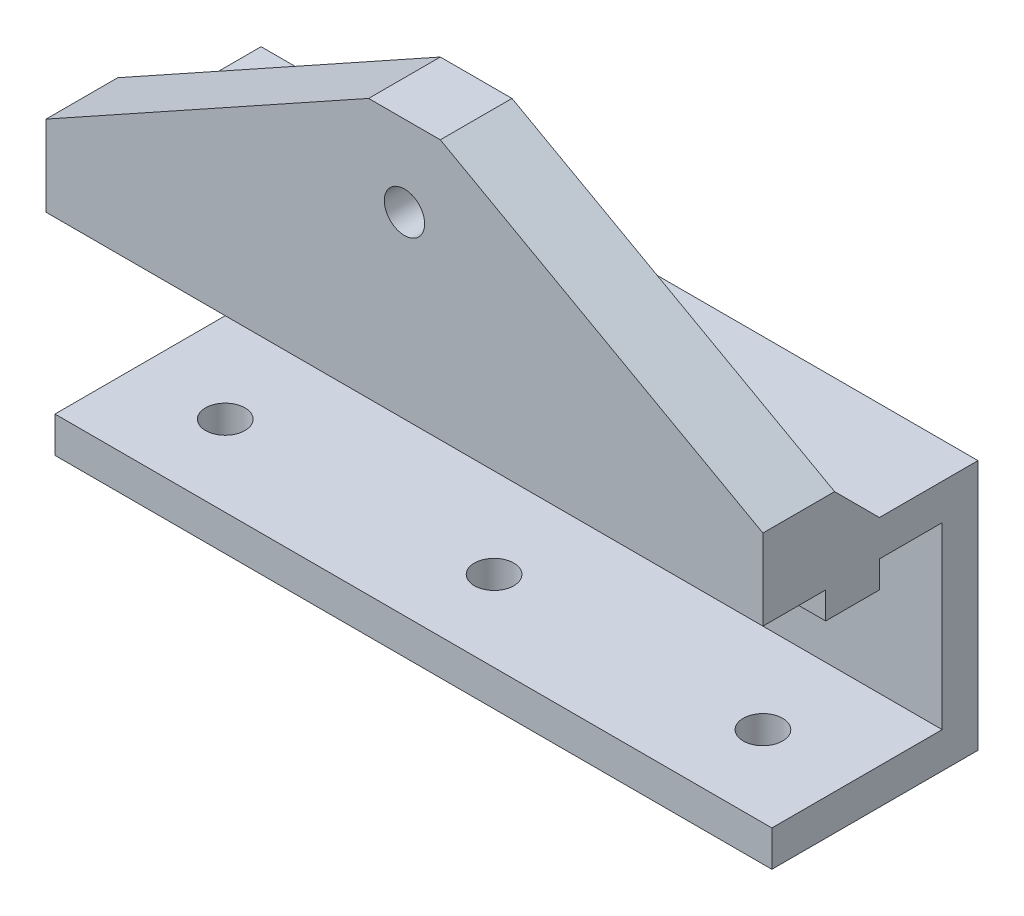
ISO-10303-21;
HEADER;
FILE_DESCRIPTION(('STEP AP214'),'2;1');
FILE_NAME('part.step','',(''),(''),'','','');
FILE_SCHEMA(('AUTOMOTIVE_DESIGN { 1 0 10303 214 1 1 1 1 }'));
ENDSEC;
DATA;
#1=APPLICATION_CONTEXT('core data for automotive mechanical design processes');
#2=APPLICATION_PROTOCOL_DEFINITION('international standard','automotive_design',2000,#1);
#3=PRODUCT_CONTEXT('',#1,'mechanical');
#4=PRODUCT('Part','Part','',(#3));
#5=PRODUCT_RELATED_PRODUCT_CATEGORY('part','',(#4));
#6=PRODUCT_DEFINITION_FORMATION('','',#4);
#7=PRODUCT_DEFINITION_CONTEXT('part definition',#1,'design');
#8=PRODUCT_DEFINITION('design','',#6,#7);
#9=PRODUCT_DEFINITION_SHAPE('','',#8);
#10=(LENGTH_UNIT() NAMED_UNIT(*) SI_UNIT(.MILLI.,.METRE.));
#11=(NAMED_UNIT(*) PLANE_ANGLE_UNIT() SI_UNIT($,.RADIAN.));
#12=(NAMED_UNIT(*) SI_UNIT($,.STERADIAN.) SOLID_ANGLE_UNIT());
#13=UNCERTAINTY_MEASURE_WITH_UNIT(LENGTH_MEASURE(1.E-05),#10,'distance_accuracy_value','');
#14=(GEOMETRIC_REPRESENTATION_CONTEXT(3) GLOBAL_UNCERTAINTY_ASSIGNED_CONTEXT((#13)) GLOBAL_UNIT_ASSIGNED_CONTEXT((#10,
#11,#12)) REPRESENTATION_CONTEXT('',''));
#15=CARTESIAN_POINT('',(0.,0.,0.));
#16=DIRECTION('',(0.,0.,1.));
#17=DIRECTION('',(1.,0.,0.));
#18=AXIS2_PLACEMENT_3D('',#15,#16,#17);
#19=CARTESIAN_POINT('',(40.,2.73442776024904,26.8389938788187));
#20=DIRECTION('',(0.,0.,-1.));
#21=DIRECTION('',(0.,1.,0.));
#22=AXIS2_PLACEMENT_3D('',#19,#20,#21);
#23=CYLINDRICAL_SURFACE('',#22,2.25);
#24=CARTESIAN_POINT('',(40.,2.73442776024905,34.8389938788187));
#25=DIRECTION('',(0.,0.,-1.));
#26=DIRECTION('',(0.,1.,0.));
#27=AXIS2_PLACEMENT_3D('',#24,#25,#26);
#28=CIRCLE('',#27,2.25);
#29=CARTESIAN_POINT('',(40.,4.98442776024905,34.8389938788187));
#30=VERTEX_POINT('',#29);
#31=EDGE_CURVE('E278',#30,#30,#28,.T.);
#32=ORIENTED_EDGE('',*,*,#31,.F.);
#33=EDGE_LOOP('',(#32));
#34=FACE_BOUND('',#33,.T.);
#35=CARTESIAN_POINT('',(40.,2.73442776024905,30.8389938788187));
#36=DIRECTION('',(0.,0.,-1.));
#37=DIRECTION('',(-1.,0.,0.));
#38=AXIS2_PLACEMENT_3D('',#35,#36,#37);
#39=CIRCLE('',#38,2.25);
#40=CARTESIAN_POINT('',(37.75,2.73442776024905,30.8389938788187));
#41=VERTEX_POINT('',#40);
#42=EDGE_CURVE('E42',#41,#41,#39,.F.);
#43=ORIENTED_EDGE('',*,*,#42,.F.);
#44=EDGE_LOOP('',(#43));
#45=FACE_BOUND('',#44,.T.);
#46=ADVANCED_FACE('F38',(#34,#45),#23,.F.);
#47=CARTESIAN_POINT('',(80.,-41.265572239751,33.8389938788187));
#48=DIRECTION('',(0.,0.,-1.));
#49=DIRECTION('',(-1.,0.,0.));
#50=AXIS2_PLACEMENT_3D('',#47,#48,#49);
#51=PLANE('',#50);
#52=DIRECTION('',(0.,-1.,0.));
#53=VECTOR('',#52,1.);
#54=CARTESIAN_POINT('',(0.,-41.265572239751,33.8389938788187));
#55=LINE('',#54,#53);
#56=CARTESIAN_POINT('',(0.,-37.265572239751,33.8389938788187));
#57=VERTEX_POINT('',#56);
#58=CARTESIAN_POINT('',(0.,-41.265572239751,33.8389938788187));
#59=VERTEX_POINT('',#58);
#60=EDGE_CURVE('E297',#57,#59,#55,.T.);
#61=ORIENTED_EDGE('',*,*,#60,.T.);
#62=DIRECTION('',(-1.,0.,0.));
#63=VECTOR('',#62,1.);
#64=CARTESIAN_POINT('',(80.,-41.265572239751,33.8389938788187));
#65=LINE('',#64,#63);
#66=CARTESIAN_POINT('',(80.,-41.265572239751,33.8389938788187));
#67=VERTEX_POINT('',#66);
#68=EDGE_CURVE('E11',#67,#59,#65,.T.);
#69=ORIENTED_EDGE('',*,*,#68,.F.);
#70=DIRECTION('',(0.,-1.,0.));
#71=VECTOR('',#70,1.);
#72=CARTESIAN_POINT('',(80.,-41.265572239751,33.8389938788187));
#73=LINE('',#72,#71);
#74=CARTESIAN_POINT('',(80.,-37.265572239751,33.8389938788187));
#75=VERTEX_POINT('',#74);
#76=EDGE_CURVE('E306',#75,#67,#73,.T.);
#77=ORIENTED_EDGE('',*,*,#76,.F.);
#78=DIRECTION('',(-1.,0.,0.));
#79=VECTOR('',#78,1.);
#80=CARTESIAN_POINT('',(80.,-37.265572239751,33.8389938788187));
#81=LINE('',#80,#79);
#82=EDGE_CURVE('E346',#75,#57,#81,.T.);
#83=ORIENTED_EDGE('',*,*,#82,.T.);
#84=EDGE_LOOP('',(#61,#69,#77,#83));
#85=FACE_BOUND('',#84,.T.);
#86=ADVANCED_FACE('F40',(#85),#51,.F.);
#87=CARTESIAN_POINT('',(80.,-41.265572239751,10.8389938788187));
#88=DIRECTION('',(0.,1.,0.));
#89=DIRECTION('',(0.,0.,1.));
#90=AXIS2_PLACEMENT_3D('',#87,#88,#89);
#91=PLANE('',#90);
#92=CARTESIAN_POINT('',(10.,-41.265572239751,24.8389938788187));
#93=DIRECTION('',(0.,-1.,0.));
#94=DIRECTION('',(0.,0.,-1.));
#95=AXIS2_PLACEMENT_3D('',#92,#93,#94);
#96=CIRCLE('',#95,2.2);
#97=CARTESIAN_POINT('',(10.,-41.265572239751,22.6389938788187));
#98=VERTEX_POINT('',#97);
#99=EDGE_CURVE('E556',#98,#98,#96,.T.);
#100=ORIENTED_EDGE('',*,*,#99,.F.);
#101=EDGE_LOOP('',(#100));
#102=FACE_BOUND('',#101,.T.);
#103=CARTESIAN_POINT('',(40.,-41.265572239751,24.8389938788187));
#104=DIRECTION('',(0.,-1.,0.));
#105=DIRECTION('',(0.,0.,-1.));
#106=AXIS2_PLACEMENT_3D('',#103,#104,#105);
#107=CIRCLE('',#106,2.2);
#108=CARTESIAN_POINT('',(40.,-41.265572239751,22.6389938788187));
#109=VERTEX_POINT('',#108);
#110=EDGE_CURVE('E562',#109,#109,#107,.T.);
#111=ORIENTED_EDGE('',*,*,#110,.F.);
#112=EDGE_LOOP('',(#111));
#113=FACE_BOUND('',#112,.T.);
#114=CARTESIAN_POINT('',(70.,-41.265572239751,24.8389938788187));
#115=DIRECTION('',(0.,-1.,0.));
#116=DIRECTION('',(0.,0.,-1.));
#117=AXIS2_PLACEMENT_3D('',#114,#115,#116);
#118=CIRCLE('',#117,2.19999999999999);
#119=CARTESIAN_POINT('',(70.,-41.265572239751,22.6389938788187));
#120=VERTEX_POINT('',#119);
#121=EDGE_CURVE('E573',#120,#120,#118,.T.);
#122=ORIENTED_EDGE('',*,*,#121,.F.);
#123=EDGE_LOOP('',(#122));
#124=FACE_BOUND('',#123,.T.);
#125=DIRECTION('',(0.,0.,-1.));
#126=VECTOR('',#125,1.);
#127=CARTESIAN_POINT('',(0.,-41.265572239751,10.8389938788187));
#128=LINE('',#127,#126);
#129=CARTESIAN_POINT('',(0.,-41.265572239751,10.8389938788187));
#130=VERTEX_POINT('',#129);
#131=EDGE_CURVE('E349',#59,#130,#128,.T.);
#132=ORIENTED_EDGE('',*,*,#131,.T.);
#133=DIRECTION('',(-1.,0.,0.));
#134=VECTOR('',#133,1.);
#135=CARTESIAN_POINT('',(80.,-41.265572239751,10.8389938788187));
#136=LINE('',#135,#134);
#137=CARTESIAN_POINT('',(80.,-41.265572239751,10.8389938788187));
#138=VERTEX_POINT('',#137);
#139=EDGE_CURVE('E48',#138,#130,#136,.T.);
#140=ORIENTED_EDGE('',*,*,#139,.F.);
#141=DIRECTION('',(0.,0.,-1.));
#142=VECTOR('',#141,1.);
#143=CARTESIAN_POINT('',(80.,-41.265572239751,10.8389938788187));
#144=LINE('',#143,#142);
#145=EDGE_CURVE('E310',#67,#138,#144,.T.);
#146=ORIENTED_EDGE('',*,*,#145,.F.);
#147=ORIENTED_EDGE('',*,*,#68,.T.);
#148=EDGE_LOOP('',(#132,#140,#146,#147));
#149=FACE_BOUND('',#148,.T.);
#150=ADVANCED_FACE('F449',(#102,#113,#124,#149),#91,.F.);
#151=CARTESIAN_POINT('',(80.,-13.265572239751,10.8389938788187));
#152=DIRECTION('',(0.,0.,1.));
#153=DIRECTION('',(0.,-1.,0.));
#154=AXIS2_PLACEMENT_3D('',#151,#152,#153);
#155=PLANE('',#154);
#156=DIRECTION('',(0.,1.,0.));
#157=VECTOR('',#156,1.);
#158=CARTESIAN_POINT('',(0.,-13.265572239751,10.8389938788187));
#159=LINE('',#158,#157);
#160=CARTESIAN_POINT('',(0.,-13.265572239751,10.8389938788187));
#161=VERTEX_POINT('',#160);
#162=EDGE_CURVE('E351',#130,#161,#159,.T.);
#163=ORIENTED_EDGE('',*,*,#162,.T.);
#164=DIRECTION('',(-1.,0.,0.));
#165=VECTOR('',#164,1.);
#166=CARTESIAN_POINT('',(80.,-13.265572239751,10.8389938788187));
#167=LINE('',#166,#165);
#168=CARTESIAN_POINT('',(80.,-13.265572239751,10.8389938788187));
#169=VERTEX_POINT('',#168);
#170=EDGE_CURVE('E419',#169,#161,#167,.T.);
#171=ORIENTED_EDGE('',*,*,#170,.F.);
#172=DIRECTION('',(0.,1.,0.));
#173=VECTOR('',#172,1.);
#174=CARTESIAN_POINT('',(80.,-13.265572239751,10.8389938788187));
#175=LINE('',#174,#173);
#176=EDGE_CURVE('E314',#138,#169,#175,.T.);
#177=ORIENTED_EDGE('',*,*,#176,.F.);
#178=ORIENTED_EDGE('',*,*,#139,.T.);
#179=EDGE_LOOP('',(#163,#171,#177,#178));
#180=FACE_BOUND('',#179,.T.);
#181=ADVANCED_FACE('F428',(#180),#155,.F.);
#182=CARTESIAN_POINT('',(80.,-13.265572239751,21.8389938788187));
#183=DIRECTION('',(0.,-1.,0.));
#184=DIRECTION('',(0.,0.,-1.));
#185=AXIS2_PLACEMENT_3D('',#182,#183,#184);
#186=PLANE('',#185);
#187=DIRECTION('',(0.,0.,1.));
#188=VECTOR('',#187,1.);
#189=CARTESIAN_POINT('',(0.,-13.265572239751,21.8389938788187));
#190=LINE('',#189,#188);
#191=CARTESIAN_POINT('',(0.,-13.265572239751,21.8389938788187));
#192=VERTEX_POINT('',#191);
#193=EDGE_CURVE('E353',#161,#192,#190,.T.);
#194=ORIENTED_EDGE('',*,*,#193,.T.);
#195=DIRECTION('',(-1.,0.,0.));
#196=VECTOR('',#195,1.);
#197=CARTESIAN_POINT('',(80.,-13.265572239751,21.8389938788187));
#198=LINE('',#197,#196);
#199=CARTESIAN_POINT('',(80.,-13.265572239751,21.8389938788187));
#200=VERTEX_POINT('',#199);
#201=EDGE_CURVE('E415',#200,#192,#198,.T.);
#202=ORIENTED_EDGE('',*,*,#201,.F.);
#203=DIRECTION('',(0.,0.,1.));
#204=VECTOR('',#203,1.);
#205=CARTESIAN_POINT('',(80.,-13.265572239751,21.8389938788187));
#206=LINE('',#205,#204);
#207=EDGE_CURVE('E317',#169,#200,#206,.T.);
#208=ORIENTED_EDGE('',*,*,#207,.F.);
#209=ORIENTED_EDGE('',*,*,#170,.T.);
#210=EDGE_LOOP('',(#194,#202,#208,#209));
#211=FACE_BOUND('',#210,.T.);
#212=ADVANCED_FACE('F438',(#211),#186,.F.);
#213=CARTESIAN_POINT('',(80.,-8.26557223975096,26.8389938788187));
#214=DIRECTION('',(0.,-0.707106781186547,0.707106781186548));
#215=DIRECTION('',(0.,-0.707106781186548,-0.707106781186547));
#216=AXIS2_PLACEMENT_3D('',#213,#214,#215);
#217=PLANE('',#216);
#218=DIRECTION('',(0.,0.707106781186548,0.707106781186547));
#219=VECTOR('',#218,1.);
#220=CARTESIAN_POINT('',(0.,-8.26557223975096,26.8389938788187));
#221=LINE('',#220,#219);
#222=CARTESIAN_POINT('',(0.,-8.26557223975096,26.8389938788187));
#223=VERTEX_POINT('',#222);
#224=EDGE_CURVE('E355',#192,#223,#221,.T.);
#225=ORIENTED_EDGE('',*,*,#224,.T.);
#226=DIRECTION('',(-1.,0.,0.));
#227=VECTOR('',#226,1.);
#228=CARTESIAN_POINT('',(80.,-8.26557223975096,26.8389938788187));
#229=LINE('',#228,#227);
#230=CARTESIAN_POINT('',(80.,-8.26557223975096,26.8389938788187));
#231=VERTEX_POINT('',#230);
#232=EDGE_CURVE('E411',#231,#223,#229,.T.);
#233=ORIENTED_EDGE('',*,*,#232,.F.);
#234=DIRECTION('',(0.,0.707106781186548,0.707106781186547));
#235=VECTOR('',#234,1.);
#236=CARTESIAN_POINT('',(80.,-8.26557223975096,26.8389938788187));
#237=LINE('',#236,#235);
#238=EDGE_CURVE('E319',#200,#231,#237,.T.);
#239=ORIENTED_EDGE('',*,*,#238,.F.);
#240=ORIENTED_EDGE('',*,*,#201,.T.);
#241=EDGE_LOOP('',(#225,#233,#239,#240));
#242=FACE_BOUND('',#241,.T.);
#243=ADVANCED_FACE('F442',(#242),#217,.F.);
#244=CARTESIAN_POINT('',(80.,11.734427760249,26.8389938788187));
#245=DIRECTION('',(0.,0.,1.));
#246=DIRECTION('',(0.,-1.,0.));
#247=AXIS2_PLACEMENT_3D('',#244,#245,#246);
#248=PLANE('',#247);
#249=DIRECTION('',(0.866025403784439,-0.5,0.));
#250=VECTOR('',#249,1.);
#251=CARTESIAN_POINT('',(40.,6.73442776024905,26.8389938788187));
#252=LINE('',#251,#250);
#253=CARTESIAN_POINT('',(40.,6.73442776024905,26.8389938788187));
#254=VERTEX_POINT('',#253);
#255=CARTESIAN_POINT('',(43.4641016151378,4.73442776024905,26.8389938788187));
#256=VERTEX_POINT('',#255);
#257=EDGE_CURVE('E254',#254,#256,#252,.T.);
#258=ORIENTED_EDGE('',*,*,#257,.F.);
#259=DIRECTION('',(0.866025403784439,0.5,0.));
#260=VECTOR('',#259,1.);
#261=CARTESIAN_POINT('',(36.5358983848622,4.73442776024904,26.8389938788187));
#262=LINE('',#261,#260);
#263=CARTESIAN_POINT('',(36.5358983848622,4.73442776024904,26.8389938788187));
#264=VERTEX_POINT('',#263);
#265=EDGE_CURVE('E55',#264,#254,#262,.T.);
#266=ORIENTED_EDGE('',*,*,#265,.F.);
#267=DIRECTION('',(0.,1.,0.));
#268=VECTOR('',#267,1.);
#269=CARTESIAN_POINT('',(36.5358983848622,0.734427760249041,26.8389938788187));
#270=LINE('',#269,#268);
#271=CARTESIAN_POINT('',(36.5358983848622,0.734427760249041,26.8389938788187));
#272=VERTEX_POINT('',#271);
#273=EDGE_CURVE('E232',#272,#264,#270,.T.);
#274=ORIENTED_EDGE('',*,*,#273,.F.);
#275=DIRECTION('',(-0.866025403784439,0.5,0.));
#276=VECTOR('',#275,1.);
#277=CARTESIAN_POINT('',(40.,-1.26557223975096,26.8389938788187));
#278=LINE('',#277,#276);
#279=CARTESIAN_POINT('',(40.,-1.26557223975096,26.8389938788187));
#280=VERTEX_POINT('',#279);
#281=EDGE_CURVE('E237',#280,#272,#278,.T.);
#282=ORIENTED_EDGE('',*,*,#281,.F.);
#283=DIRECTION('',(-0.866025403784439,-0.5,0.));
#284=VECTOR('',#283,1.);
#285=CARTESIAN_POINT('',(43.4641016151378,0.734427760249036,26.8389938788187));
#286=LINE('',#285,#284);
#287=CARTESIAN_POINT('',(43.4641016151378,0.734427760249036,26.8389938788187));
#288=VERTEX_POINT('',#287);
#289=EDGE_CURVE('E259',#288,#280,#286,.T.);
#290=ORIENTED_EDGE('',*,*,#289,.F.);
#291=DIRECTION('',(0.,-1.,0.));
#292=VECTOR('',#291,1.);
#293=CARTESIAN_POINT('',(43.4641016151378,4.73442776024905,26.8389938788187));
#294=LINE('',#293,#292);
#295=EDGE_CURVE('E256',#256,#288,#294,.T.);
#296=ORIENTED_EDGE('',*,*,#295,.F.);
#297=EDGE_LOOP('',(#258,#266,#274,#282,#290,#296));
#298=FACE_BOUND('',#297,.T.);
#299=ORIENTED_EDGE('',*,*,#232,.T.);
#300=DIRECTION('',(-0.874157276121538,-0.485642931178632,0.));
#301=VECTOR('',#300,1.);
#302=CARTESIAN_POINT('',(36.,11.734427760249,26.8389938788187));
#303=LINE('',#302,#301);
#304=CARTESIAN_POINT('',(36.,11.734427760249,26.8389938788187));
#305=VERTEX_POINT('',#304);
#306=EDGE_CURVE('E286',#305,#223,#303,.T.);
#307=ORIENTED_EDGE('',*,*,#306,.F.);
#308=DIRECTION('',(-1.,0.,0.));
#309=VECTOR('',#308,1.);
#310=CARTESIAN_POINT('',(80.,11.734427760249,26.8389938788187));
#311=LINE('',#310,#309);
#312=CARTESIAN_POINT('',(44.,11.734427760249,26.8389938788187));
#313=VERTEX_POINT('',#312);
#314=EDGE_CURVE('E408',#313,#305,#311,.T.);
#315=ORIENTED_EDGE('',*,*,#314,.F.);
#316=DIRECTION('',(-0.874157276121538,0.485642931178632,0.));
#317=VECTOR('',#316,1.);
#318=CARTESIAN_POINT('',(80.,-8.26557223975096,26.8389938788187));
#319=LINE('',#318,#317);
#320=EDGE_CURVE('E282',#231,#313,#319,.T.);
#321=ORIENTED_EDGE('',*,*,#320,.F.);
#322=EDGE_LOOP('',(#299,#307,#315,#321));
#323=FACE_BOUND('',#322,.T.);
#324=ADVANCED_FACE('F500',(#298,#323),#248,.F.);
#325=CARTESIAN_POINT('',(80.,11.734427760249,34.8389938788187));
#326=DIRECTION('',(0.,-1.,0.));
#327=DIRECTION('',(0.,0.,-1.));
#328=AXIS2_PLACEMENT_3D('',#325,#326,#327);
#329=PLANE('',#328);
#330=ORIENTED_EDGE('',*,*,#314,.T.);
#331=DIRECTION('',(0.,0.,-1.));
#332=VECTOR('',#331,1.);
#333=CARTESIAN_POINT('',(36.,11.734427760249,34.8389938788187));
#334=LINE('',#333,#332);
#335=CARTESIAN_POINT('',(36.,11.734427760249,34.8389938788187));
#336=VERTEX_POINT('',#335);
#337=EDGE_CURVE('E298',#336,#305,#334,.T.);
#338=ORIENTED_EDGE('',*,*,#337,.F.);
#339=DIRECTION('',(-1.,0.,0.));
#340=VECTOR('',#339,1.);
#341=CARTESIAN_POINT('',(80.,11.734427760249,34.8389938788187));
#342=LINE('',#341,#340);
#343=CARTESIAN_POINT('',(44.,11.734427760249,34.8389938788187));
#344=VERTEX_POINT('',#343);
#345=EDGE_CURVE('E404',#344,#336,#342,.T.);
#346=ORIENTED_EDGE('',*,*,#345,.F.);
#347=DIRECTION('',(0.,0.,-1.));
#348=VECTOR('',#347,1.);
#349=CARTESIAN_POINT('',(44.,11.734427760249,34.8389938788187));
#350=LINE('',#349,#348);
#351=EDGE_CURVE('E301',#344,#313,#350,.T.);
#352=ORIENTED_EDGE('',*,*,#351,.T.);
#353=EDGE_LOOP('',(#330,#338,#346,#352));
#354=FACE_BOUND('',#353,.T.);
#355=ADVANCED_FACE('F496',(#354),#329,.F.);
#356=CARTESIAN_POINT('',(80.,-17.265572239751,34.8389938788187));
#357=DIRECTION('',(0.,0.,-1.));
#358=DIRECTION('',(0.,1.,0.));
#359=AXIS2_PLACEMENT_3D('',#356,#357,#358);
#360=PLANE('',#359);
#361=ORIENTED_EDGE('',*,*,#31,.T.);
#362=EDGE_LOOP('',(#361));
#363=FACE_BOUND('',#362,.T.);
#364=ORIENTED_EDGE('',*,*,#345,.T.);
#365=DIRECTION('',(-0.874157276121538,-0.485642931178632,0.));
#366=VECTOR('',#365,1.);
#367=CARTESIAN_POINT('',(36.,11.734427760249,34.8389938788187));
#368=LINE('',#367,#366);
#369=CARTESIAN_POINT('',(0.,-8.26557223975095,34.8389938788187));
#370=VERTEX_POINT('',#369);
#371=EDGE_CURVE('E285',#336,#370,#368,.T.);
#372=ORIENTED_EDGE('',*,*,#371,.T.);
#373=DIRECTION('',(0.,-1.,0.));
#374=VECTOR('',#373,1.);
#375=CARTESIAN_POINT('',(0.,-17.265572239751,34.8389938788187));
#376=LINE('',#375,#374);
#377=CARTESIAN_POINT('',(0.,-17.265572239751,34.8389938788187));
#378=VERTEX_POINT('',#377);
#379=EDGE_CURVE('E358',#370,#378,#376,.T.);
#380=ORIENTED_EDGE('',*,*,#379,.T.);
#381=DIRECTION('',(-1.,0.,0.));
#382=VECTOR('',#381,1.);
#383=CARTESIAN_POINT('',(80.,-17.265572239751,34.8389938788187));
#384=LINE('',#383,#382);
#385=CARTESIAN_POINT('',(80.,-17.265572239751,34.8389938788187));
#386=VERTEX_POINT('',#385);
#387=EDGE_CURVE('E400',#386,#378,#384,.T.);
#388=ORIENTED_EDGE('',*,*,#387,.F.);
#389=DIRECTION('',(0.,-1.,0.));
#390=VECTOR('',#389,1.);
#391=CARTESIAN_POINT('',(80.,-17.265572239751,34.8389938788187));
#392=LINE('',#391,#390);
#393=CARTESIAN_POINT('',(80.,-8.26557223975096,34.8389938788187));
#394=VERTEX_POINT('',#393);
#395=EDGE_CURVE('E322',#394,#386,#392,.T.);
#396=ORIENTED_EDGE('',*,*,#395,.F.);
#397=DIRECTION('',(-0.874157276121538,0.485642931178632,0.));
#398=VECTOR('',#397,1.);
#399=CARTESIAN_POINT('',(80.,-8.26557223975095,34.8389938788187));
#400=LINE('',#399,#398);
#401=EDGE_CURVE('E66',#394,#344,#400,.T.);
#402=ORIENTED_EDGE('',*,*,#401,.T.);
#403=EDGE_LOOP('',(#364,#372,#380,#388,#396,#402));
#404=FACE_BOUND('',#403,.T.);
#405=ADVANCED_FACE('F489',(#363,#404),#360,.F.);
#406=CARTESIAN_POINT('',(80.,-17.265572239751,27.8389938788187));
#407=DIRECTION('',(0.,1.,0.));
#408=DIRECTION('',(0.,0.,1.));
#409=AXIS2_PLACEMENT_3D('',#406,#407,#408);
#410=PLANE('',#409);
#411=DIRECTION('',(0.,0.,-1.));
#412=VECTOR('',#411,1.);
#413=CARTESIAN_POINT('',(0.,-17.265572239751,27.8389938788187));
#414=LINE('',#413,#412);
#415=CARTESIAN_POINT('',(0.,-17.265572239751,27.8389938788187));
#416=VERTEX_POINT('',#415);
#417=EDGE_CURVE('E360',#378,#416,#414,.T.);
#418=ORIENTED_EDGE('',*,*,#417,.T.);
#419=DIRECTION('',(-1.,0.,0.));
#420=VECTOR('',#419,1.);
#421=CARTESIAN_POINT('',(80.,-17.265572239751,27.8389938788187));
#422=LINE('',#421,#420);
#423=CARTESIAN_POINT('',(80.,-17.265572239751,27.8389938788187));
#424=VERTEX_POINT('',#423);
#425=EDGE_CURVE('E396',#424,#416,#422,.T.);
#426=ORIENTED_EDGE('',*,*,#425,.F.);
#427=DIRECTION('',(0.,0.,-1.));
#428=VECTOR('',#427,1.);
#429=CARTESIAN_POINT('',(80.,-17.265572239751,27.8389938788187));
#430=LINE('',#429,#428);
#431=EDGE_CURVE('E325',#386,#424,#430,.T.);
#432=ORIENTED_EDGE('',*,*,#431,.F.);
#433=ORIENTED_EDGE('',*,*,#387,.T.);
#434=EDGE_LOOP('',(#418,#426,#432,#433));
#435=FACE_BOUND('',#434,.T.);
#436=ADVANCED_FACE('F485',(#435),#410,.F.);
#437=CARTESIAN_POINT('',(80.,-20.265572239751,27.8389938788187));
#438=DIRECTION('',(0.,0.,-1.));
#439=DIRECTION('',(-1.,0.,0.));
#440=AXIS2_PLACEMENT_3D('',#437,#438,#439);
#441=PLANE('',#440);
#442=DIRECTION('',(0.,-1.,0.));
#443=VECTOR('',#442,1.);
#444=CARTESIAN_POINT('',(0.,-20.265572239751,27.8389938788187));
#445=LINE('',#444,#443);
#446=CARTESIAN_POINT('',(0.,-20.265572239751,27.8389938788187));
#447=VERTEX_POINT('',#446);
#448=EDGE_CURVE('E362',#416,#447,#445,.T.);
#449=ORIENTED_EDGE('',*,*,#448,.T.);
#450=DIRECTION('',(-1.,0.,0.));
#451=VECTOR('',#450,1.);
#452=CARTESIAN_POINT('',(80.,-20.265572239751,27.8389938788187));
#453=LINE('',#452,#451);
#454=CARTESIAN_POINT('',(80.,-20.265572239751,27.8389938788187));
#455=VERTEX_POINT('',#454);
#456=EDGE_CURVE('E392',#455,#447,#453,.T.);
#457=ORIENTED_EDGE('',*,*,#456,.F.);
#458=DIRECTION('',(0.,-1.,0.));
#459=VECTOR('',#458,1.);
#460=CARTESIAN_POINT('',(80.,-20.265572239751,27.8389938788187));
#461=LINE('',#460,#459);
#462=EDGE_CURVE('E328',#424,#455,#461,.T.);
#463=ORIENTED_EDGE('',*,*,#462,.F.);
#464=ORIENTED_EDGE('',*,*,#425,.T.);
#465=EDGE_LOOP('',(#449,#457,#463,#464));
#466=FACE_BOUND('',#465,.T.);
#467=ADVANCED_FACE('F480',(#466),#441,.F.);
#468=CARTESIAN_POINT('',(80.,-20.265572239751,21.8389938788187));
#469=DIRECTION('',(0.,1.,0.));
#470=DIRECTION('',(0.,0.,1.));
#471=AXIS2_PLACEMENT_3D('',#468,#469,#470);
#472=PLANE('',#471);
#473=DIRECTION('',(0.,0.,-1.));
#474=VECTOR('',#473,1.);
#475=CARTESIAN_POINT('',(0.,-20.265572239751,21.8389938788187));
#476=LINE('',#475,#474);
#477=CARTESIAN_POINT('',(0.,-20.265572239751,21.8389938788187));
#478=VERTEX_POINT('',#477);
#479=EDGE_CURVE('E364',#447,#478,#476,.T.);
#480=ORIENTED_EDGE('',*,*,#479,.T.);
#481=DIRECTION('',(-1.,0.,0.));
#482=VECTOR('',#481,1.);
#483=CARTESIAN_POINT('',(80.,-20.265572239751,21.8389938788187));
#484=LINE('',#483,#482);
#485=CARTESIAN_POINT('',(80.,-20.265572239751,21.8389938788187));
#486=VERTEX_POINT('',#485);
#487=EDGE_CURVE('E388',#486,#478,#484,.T.);
#488=ORIENTED_EDGE('',*,*,#487,.F.);
#489=DIRECTION('',(0.,0.,-1.));
#490=VECTOR('',#489,1.);
#491=CARTESIAN_POINT('',(80.,-20.265572239751,21.8389938788187));
#492=LINE('',#491,#490);
#493=EDGE_CURVE('E331',#455,#486,#492,.T.);
#494=ORIENTED_EDGE('',*,*,#493,.F.);
#495=ORIENTED_EDGE('',*,*,#456,.T.);
#496=EDGE_LOOP('',(#480,#488,#494,#495));
#497=FACE_BOUND('',#496,.T.);
#498=ADVANCED_FACE('F476',(#497),#472,.F.);
#499=CARTESIAN_POINT('',(80.,-17.265572239751,21.8389938788187));
#500=DIRECTION('',(0.,0.,1.));
#501=DIRECTION('',(0.,-1.,0.));
#502=AXIS2_PLACEMENT_3D('',#499,#500,#501);
#503=PLANE('',#502);
#504=DIRECTION('',(0.,1.,0.));
#505=VECTOR('',#504,1.);
#506=CARTESIAN_POINT('',(0.,-17.265572239751,21.8389938788187));
#507=LINE('',#506,#505);
#508=CARTESIAN_POINT('',(0.,-17.265572239751,21.8389938788187));
#509=VERTEX_POINT('',#508);
#510=EDGE_CURVE('E366',#478,#509,#507,.T.);
#511=ORIENTED_EDGE('',*,*,#510,.T.);
#512=DIRECTION('',(-1.,0.,0.));
#513=VECTOR('',#512,1.);
#514=CARTESIAN_POINT('',(80.,-17.265572239751,21.8389938788187));
#515=LINE('',#514,#513);
#516=CARTESIAN_POINT('',(80.,-17.265572239751,21.8389938788187));
#517=VERTEX_POINT('',#516);
#518=EDGE_CURVE('E384',#517,#509,#515,.T.);
#519=ORIENTED_EDGE('',*,*,#518,.F.);
#520=DIRECTION('',(0.,1.,0.));
#521=VECTOR('',#520,1.);
#522=CARTESIAN_POINT('',(80.,-17.265572239751,21.8389938788187));
#523=LINE('',#522,#521);
#524=EDGE_CURVE('E334',#486,#517,#523,.T.);
#525=ORIENTED_EDGE('',*,*,#524,.F.);
#526=ORIENTED_EDGE('',*,*,#487,.T.);
#527=EDGE_LOOP('',(#511,#519,#525,#526));
#528=FACE_BOUND('',#527,.T.);
#529=ADVANCED_FACE('F471',(#528),#503,.F.);
#530=CARTESIAN_POINT('',(80.,-17.265572239751,14.8389938788187));
#531=DIRECTION('',(0.,1.,0.));
#532=DIRECTION('',(0.,0.,1.));
#533=AXIS2_PLACEMENT_3D('',#530,#531,#532);
#534=PLANE('',#533);
#535=DIRECTION('',(0.,0.,-1.));
#536=VECTOR('',#535,1.);
#537=CARTESIAN_POINT('',(0.,-17.265572239751,14.8389938788187));
#538=LINE('',#537,#536);
#539=CARTESIAN_POINT('',(0.,-17.265572239751,14.8389938788187));
#540=VERTEX_POINT('',#539);
#541=EDGE_CURVE('E368',#509,#540,#538,.T.);
#542=ORIENTED_EDGE('',*,*,#541,.T.);
#543=DIRECTION('',(-1.,0.,0.));
#544=VECTOR('',#543,1.);
#545=CARTESIAN_POINT('',(80.,-17.265572239751,14.8389938788187));
#546=LINE('',#545,#544);
#547=CARTESIAN_POINT('',(80.,-17.265572239751,14.8389938788187));
#548=VERTEX_POINT('',#547);
#549=EDGE_CURVE('E380',#548,#540,#546,.T.);
#550=ORIENTED_EDGE('',*,*,#549,.F.);
#551=DIRECTION('',(0.,0.,-1.));
#552=VECTOR('',#551,1.);
#553=CARTESIAN_POINT('',(80.,-17.265572239751,14.8389938788187));
#554=LINE('',#553,#552);
#555=EDGE_CURVE('E337',#517,#548,#554,.T.);
#556=ORIENTED_EDGE('',*,*,#555,.F.);
#557=ORIENTED_EDGE('',*,*,#518,.T.);
#558=EDGE_LOOP('',(#542,#550,#556,#557));
#559=FACE_BOUND('',#558,.T.);
#560=ADVANCED_FACE('F465',(#559),#534,.F.);
#561=CARTESIAN_POINT('',(80.,-37.265572239751,14.8389938788187));
#562=DIRECTION('',(0.,0.,-1.));
#563=DIRECTION('',(-1.,0.,0.));
#564=AXIS2_PLACEMENT_3D('',#561,#562,#563);
#565=PLANE('',#564);
#566=DIRECTION('',(0.,-1.,0.));
#567=VECTOR('',#566,1.);
#568=CARTESIAN_POINT('',(0.,-37.265572239751,14.8389938788187));
#569=LINE('',#568,#567);
#570=CARTESIAN_POINT('',(0.,-37.265572239751,14.8389938788187));
#571=VERTEX_POINT('',#570);
#572=EDGE_CURVE('E370',#540,#571,#569,.T.);
#573=ORIENTED_EDGE('',*,*,#572,.T.);
#574=DIRECTION('',(-1.,0.,0.));
#575=VECTOR('',#574,1.);
#576=CARTESIAN_POINT('',(80.,-37.265572239751,14.8389938788187));
#577=LINE('',#576,#575);
#578=CARTESIAN_POINT('',(80.,-37.265572239751,14.8389938788187));
#579=VERTEX_POINT('',#578);
#580=EDGE_CURVE('E376',#579,#571,#577,.T.);
#581=ORIENTED_EDGE('',*,*,#580,.F.);
#582=DIRECTION('',(0.,-1.,0.));
#583=VECTOR('',#582,1.);
#584=CARTESIAN_POINT('',(80.,-37.265572239751,14.8389938788187));
#585=LINE('',#584,#583);
#586=EDGE_CURVE('E340',#548,#579,#585,.T.);
#587=ORIENTED_EDGE('',*,*,#586,.F.);
#588=ORIENTED_EDGE('',*,*,#549,.T.);
#589=EDGE_LOOP('',(#573,#581,#587,#588));
#590=FACE_BOUND('',#589,.T.);
#591=ADVANCED_FACE('F461',(#590),#565,.F.);
#592=CARTESIAN_POINT('',(80.,-37.265572239751,33.8389938788187));
#593=DIRECTION('',(0.,-1.,0.));
#594=DIRECTION('',(0.,0.,-1.));
#595=AXIS2_PLACEMENT_3D('',#592,#593,#594);
#596=PLANE('',#595);
#597=CARTESIAN_POINT('',(10.,-37.265572239751,24.8389938788187));
#598=DIRECTION('',(0.,-1.,0.));
#599=DIRECTION('',(0.,0.,-1.));
#600=AXIS2_PLACEMENT_3D('',#597,#598,#599);
#601=CIRCLE('',#600,2.2);
#602=CARTESIAN_POINT('',(10.,-37.265572239751,22.6389938788187));
#603=VERTEX_POINT('',#602);
#604=EDGE_CURVE('E559',#603,#603,#601,.T.);
#605=ORIENTED_EDGE('',*,*,#604,.T.);
#606=EDGE_LOOP('',(#605));
#607=FACE_BOUND('',#606,.T.);
#608=CARTESIAN_POINT('',(40.,-37.265572239751,24.8389938788187));
#609=DIRECTION('',(0.,-1.,0.));
#610=DIRECTION('',(0.,0.,-1.));
#611=AXIS2_PLACEMENT_3D('',#608,#609,#610);
#612=CIRCLE('',#611,2.2);
#613=CARTESIAN_POINT('',(40.,-37.265572239751,22.6389938788187));
#614=VERTEX_POINT('',#613);
#615=EDGE_CURVE('E567',#614,#614,#612,.T.);
#616=ORIENTED_EDGE('',*,*,#615,.T.);
#617=EDGE_LOOP('',(#616));
#618=FACE_BOUND('',#617,.T.);
#619=CARTESIAN_POINT('',(70.,-37.265572239751,24.8389938788187));
#620=DIRECTION('',(0.,-1.,0.));
#621=DIRECTION('',(0.,0.,-1.));
#622=AXIS2_PLACEMENT_3D('',#619,#620,#621);
#623=CIRCLE('',#622,2.19999999999999);
#624=CARTESIAN_POINT('',(70.,-37.265572239751,22.6389938788187));
#625=VERTEX_POINT('',#624);
#626=EDGE_CURVE('E240',#625,#625,#623,.T.);
#627=ORIENTED_EDGE('',*,*,#626,.T.);
#628=EDGE_LOOP('',(#627));
#629=FACE_BOUND('',#628,.T.);
#630=DIRECTION('',(0.,0.,1.));
#631=VECTOR('',#630,1.);
#632=CARTESIAN_POINT('',(0.,-37.265572239751,33.8389938788187));
#633=LINE('',#632,#631);
#634=EDGE_CURVE('E311',#571,#57,#633,.T.);
#635=ORIENTED_EDGE('',*,*,#634,.T.);
#636=ORIENTED_EDGE('',*,*,#82,.F.);
#637=DIRECTION('',(0.,0.,1.));
#638=VECTOR('',#637,1.);
#639=CARTESIAN_POINT('',(80.,-37.265572239751,33.8389938788187));
#640=LINE('',#639,#638);
#641=EDGE_CURVE('E343',#579,#75,#640,.T.);
#642=ORIENTED_EDGE('',*,*,#641,.F.);
#643=ORIENTED_EDGE('',*,*,#580,.T.);
#644=EDGE_LOOP('',(#635,#636,#642,#643));
#645=FACE_BOUND('',#644,.T.);
#646=ADVANCED_FACE('F456',(#607,#618,#629,#645),#596,.F.);
#647=CARTESIAN_POINT('',(80.,0.,0.));
#648=DIRECTION('',(-1.,0.,0.));
#649=DIRECTION('',(0.,0.,1.));
#650=AXIS2_PLACEMENT_3D('',#647,#648,#649);
#651=PLANE('',#650);
#652=ORIENTED_EDGE('',*,*,#238,.T.);
#653=DIRECTION('',(0.,0.,-1.));
#654=VECTOR('',#653,1.);
#655=CARTESIAN_POINT('',(80.,-8.26557223975095,34.8389938788187));
#656=LINE('',#655,#654);
#657=EDGE_CURVE('E290',#394,#231,#656,.T.);
#658=ORIENTED_EDGE('',*,*,#657,.F.);
#659=ORIENTED_EDGE('',*,*,#395,.T.);
#660=ORIENTED_EDGE('',*,*,#431,.T.);
#661=ORIENTED_EDGE('',*,*,#462,.T.);
#662=ORIENTED_EDGE('',*,*,#493,.T.);
#663=ORIENTED_EDGE('',*,*,#524,.T.);
#664=ORIENTED_EDGE('',*,*,#555,.T.);
#665=ORIENTED_EDGE('',*,*,#586,.T.);
#666=ORIENTED_EDGE('',*,*,#641,.T.);
#667=ORIENTED_EDGE('',*,*,#76,.T.);
#668=ORIENTED_EDGE('',*,*,#145,.T.);
#669=ORIENTED_EDGE('',*,*,#176,.T.);
#670=ORIENTED_EDGE('',*,*,#207,.T.);
#671=EDGE_LOOP('',(#652,#658,#659,#660,#661,#662,#663,#664,#665,#666,#667,#668,#669,#670));
#672=FACE_BOUND('',#671,.T.);
#673=ADVANCED_FACE('F445',(#672),#651,.F.);
#674=CARTESIAN_POINT('',(0.,0.,0.));
#675=DIRECTION('',(-1.,0.,0.));
#676=DIRECTION('',(0.,0.,1.));
#677=AXIS2_PLACEMENT_3D('',#674,#675,#676);
#678=PLANE('',#677);
#679=DIRECTION('',(0.,0.,-1.));
#680=VECTOR('',#679,1.);
#681=CARTESIAN_POINT('',(0.,-8.26557223975095,34.8389938788187));
#682=LINE('',#681,#680);
#683=EDGE_CURVE('E294',#370,#223,#682,.T.);
#684=ORIENTED_EDGE('',*,*,#683,.T.);
#685=ORIENTED_EDGE('',*,*,#224,.F.);
#686=ORIENTED_EDGE('',*,*,#193,.F.);
#687=ORIENTED_EDGE('',*,*,#162,.F.);
#688=ORIENTED_EDGE('',*,*,#131,.F.);
#689=ORIENTED_EDGE('',*,*,#60,.F.);
#690=ORIENTED_EDGE('',*,*,#634,.F.);
#691=ORIENTED_EDGE('',*,*,#572,.F.);
#692=ORIENTED_EDGE('',*,*,#541,.F.);
#693=ORIENTED_EDGE('',*,*,#510,.F.);
#694=ORIENTED_EDGE('',*,*,#479,.F.);
#695=ORIENTED_EDGE('',*,*,#448,.F.);
#696=ORIENTED_EDGE('',*,*,#417,.F.);
#697=ORIENTED_EDGE('',*,*,#379,.F.);
#698=EDGE_LOOP('',(#684,#685,#686,#687,#688,#689,#690,#691,#692,#693,#694,#695,#696,#697));
#699=FACE_BOUND('',#698,.T.);
#700=ADVANCED_FACE('F433',(#699),#678,.T.);
#701=CARTESIAN_POINT('',(36.,11.734427760249,34.8389938788187));
#702=DIRECTION('',(0.485642931178632,-0.874157276121538,0.));
#703=DIRECTION('',(0.874157276121538,0.485642931178632,0.));
#704=AXIS2_PLACEMENT_3D('',#701,#702,#703);
#705=PLANE('',#704);
#706=ORIENTED_EDGE('',*,*,#306,.T.);
#707=ORIENTED_EDGE('',*,*,#683,.F.);
#708=ORIENTED_EDGE('',*,*,#371,.F.);
#709=ORIENTED_EDGE('',*,*,#337,.T.);
#710=EDGE_LOOP('',(#706,#707,#708,#709));
#711=FACE_BOUND('',#710,.T.);
#712=ADVANCED_FACE('F493',(#711),#705,.F.);
#713=CARTESIAN_POINT('',(80.,-8.26557223975095,34.8389938788187));
#714=DIRECTION('',(-0.485642931178632,-0.874157276121538,0.));
#715=DIRECTION('',(0.874157276121538,-0.485642931178632,0.));
#716=AXIS2_PLACEMENT_3D('',#713,#714,#715);
#717=PLANE('',#716);
#718=ORIENTED_EDGE('',*,*,#320,.T.);
#719=ORIENTED_EDGE('',*,*,#351,.F.);
#720=ORIENTED_EDGE('',*,*,#401,.F.);
#721=ORIENTED_EDGE('',*,*,#657,.T.);
#722=EDGE_LOOP('',(#718,#719,#720,#721));
#723=FACE_BOUND('',#722,.T.);
#724=ADVANCED_FACE('F501',(#723),#717,.F.);
#725=CARTESIAN_POINT('',(0.,0.,30.8389938788187));
#726=DIRECTION('',(0.,0.,-1.));
#727=DIRECTION('',(-1.,0.,0.));
#728=AXIS2_PLACEMENT_3D('',#725,#726,#727);
#729=PLANE('',#728);
#730=DIRECTION('',(0.866025403784439,0.5,0.));
#731=VECTOR('',#730,1.);
#732=CARTESIAN_POINT('',(36.5358983848622,4.73442776024904,30.8389938788187));
#733=LINE('',#732,#731);
#734=CARTESIAN_POINT('',(36.5358983848622,4.73442776024904,30.8389938788187));
#735=VERTEX_POINT('',#734);
#736=CARTESIAN_POINT('',(40.,6.73442776024905,30.8389938788187));
#737=VERTEX_POINT('',#736);
#738=EDGE_CURVE('E209',#735,#737,#733,.T.);
#739=ORIENTED_EDGE('',*,*,#738,.T.);
#740=DIRECTION('',(0.866025403784439,-0.5,0.));
#741=VECTOR('',#740,1.);
#742=CARTESIAN_POINT('',(40.,6.73442776024905,30.8389938788187));
#743=LINE('',#742,#741);
#744=CARTESIAN_POINT('',(43.4641016151378,4.73442776024905,30.8389938788187));
#745=VERTEX_POINT('',#744);
#746=EDGE_CURVE('E219',#737,#745,#743,.T.);
#747=ORIENTED_EDGE('',*,*,#746,.T.);
#748=DIRECTION('',(0.,-1.,0.));
#749=VECTOR('',#748,1.);
#750=CARTESIAN_POINT('',(43.4641016151378,4.73442776024905,30.8389938788187));
#751=LINE('',#750,#749);
#752=CARTESIAN_POINT('',(43.4641016151378,0.734427760249038,30.8389938788187));
#753=VERTEX_POINT('',#752);
#754=EDGE_CURVE('E225',#745,#753,#751,.T.);
#755=ORIENTED_EDGE('',*,*,#754,.T.);
#756=DIRECTION('',(-0.866025403784439,-0.5,0.));
#757=VECTOR('',#756,1.);
#758=CARTESIAN_POINT('',(43.4641016151378,0.734427760249038,30.8389938788187));
#759=LINE('',#758,#757);
#760=CARTESIAN_POINT('',(40.,-1.26557223975096,30.8389938788187));
#761=VERTEX_POINT('',#760);
#762=EDGE_CURVE('E244',#753,#761,#759,.T.);
#763=ORIENTED_EDGE('',*,*,#762,.T.);
#764=DIRECTION('',(-0.866025403784439,0.5,0.));
#765=VECTOR('',#764,1.);
#766=CARTESIAN_POINT('',(40.,-1.26557223975096,30.8389938788187));
#767=LINE('',#766,#765);
#768=CARTESIAN_POINT('',(36.5358983848622,0.734427760249043,30.8389938788187));
#769=VERTEX_POINT('',#768);
#770=EDGE_CURVE('E248',#761,#769,#767,.T.);
#771=ORIENTED_EDGE('',*,*,#770,.T.);
#772=DIRECTION('',(0.,1.,0.));
#773=VECTOR('',#772,1.);
#774=CARTESIAN_POINT('',(36.5358983848622,0.734427760249043,30.8389938788187));
#775=LINE('',#774,#773);
#776=EDGE_CURVE('E216',#769,#735,#775,.T.);
#777=ORIENTED_EDGE('',*,*,#776,.T.);
#778=EDGE_LOOP('',(#739,#747,#755,#763,#771,#777));
#779=FACE_BOUND('',#778,.T.);
#780=ORIENTED_EDGE('',*,*,#42,.T.);
#781=EDGE_LOOP('',(#780));
#782=FACE_BOUND('',#781,.T.);
#783=ADVANCED_FACE('F227',(#779,#782),#729,.T.);
#784=CARTESIAN_POINT('',(36.5358983848622,4.73442776024904,30.8389938788187));
#785=DIRECTION('',(-0.5,0.866025403784439,0.));
#786=DIRECTION('',(-0.866025403784439,-0.5,0.));
#787=AXIS2_PLACEMENT_3D('',#784,#785,#786);
#788=PLANE('',#787);
#789=ORIENTED_EDGE('',*,*,#265,.T.);
#790=DIRECTION('',(0.,0.,-1.));
#791=VECTOR('',#790,1.);
#792=CARTESIAN_POINT('',(40.,6.73442776024905,30.8389938788187));
#793=LINE('',#792,#791);
#794=EDGE_CURVE('E205',#737,#254,#793,.T.);
#795=ORIENTED_EDGE('',*,*,#794,.F.);
#796=ORIENTED_EDGE('',*,*,#738,.F.);
#797=DIRECTION('',(0.,0.,-1.));
#798=VECTOR('',#797,1.);
#799=CARTESIAN_POINT('',(36.5358983848622,4.73442776024904,30.8389938788187));
#800=LINE('',#799,#798);
#801=EDGE_CURVE('E266',#735,#264,#800,.T.);
#802=ORIENTED_EDGE('',*,*,#801,.T.);
#803=EDGE_LOOP('',(#789,#795,#796,#802));
#804=FACE_BOUND('',#803,.T.);
#805=ADVANCED_FACE('F207',(#804),#788,.F.);
#806=CARTESIAN_POINT('',(36.5358983848622,0.734427760249043,30.8389938788187));
#807=DIRECTION('',(-1.,0.,0.));
#808=DIRECTION('',(0.,0.,1.));
#809=AXIS2_PLACEMENT_3D('',#806,#807,#808);
#810=PLANE('',#809);
#811=ORIENTED_EDGE('',*,*,#273,.T.);
#812=ORIENTED_EDGE('',*,*,#801,.F.);
#813=ORIENTED_EDGE('',*,*,#776,.F.);
#814=DIRECTION('',(0.,0.,-1.));
#815=VECTOR('',#814,1.);
#816=CARTESIAN_POINT('',(36.5358983848622,0.734427760249043,30.8389938788187));
#817=LINE('',#816,#815);
#818=EDGE_CURVE('E269',#769,#272,#817,.T.);
#819=ORIENTED_EDGE('',*,*,#818,.T.);
#820=EDGE_LOOP('',(#811,#812,#813,#819));
#821=FACE_BOUND('',#820,.T.);
#822=ADVANCED_FACE('F522',(#821),#810,.F.);
#823=CARTESIAN_POINT('',(40.,-1.26557223975096,30.8389938788187));
#824=DIRECTION('',(-0.5,-0.866025403784439,0.));
#825=DIRECTION('',(0.866025403784439,-0.5,0.));
#826=AXIS2_PLACEMENT_3D('',#823,#824,#825);
#827=PLANE('',#826);
#828=ORIENTED_EDGE('',*,*,#281,.T.);
#829=ORIENTED_EDGE('',*,*,#818,.F.);
#830=ORIENTED_EDGE('',*,*,#770,.F.);
#831=DIRECTION('',(0.,0.,-1.));
#832=VECTOR('',#831,1.);
#833=CARTESIAN_POINT('',(40.,-1.26557223975096,30.8389938788187));
#834=LINE('',#833,#832);
#835=EDGE_CURVE('E272',#761,#280,#834,.T.);
#836=ORIENTED_EDGE('',*,*,#835,.T.);
#837=EDGE_LOOP('',(#828,#829,#830,#836));
#838=FACE_BOUND('',#837,.T.);
#839=ADVANCED_FACE('F533',(#838),#827,.F.);
#840=CARTESIAN_POINT('',(43.4641016151378,0.734427760249038,30.8389938788187));
#841=DIRECTION('',(0.5,-0.866025403784439,0.));
#842=DIRECTION('',(0.866025403784439,0.5,0.));
#843=AXIS2_PLACEMENT_3D('',#840,#841,#842);
#844=PLANE('',#843);
#845=ORIENTED_EDGE('',*,*,#289,.T.);
#846=ORIENTED_EDGE('',*,*,#835,.F.);
#847=ORIENTED_EDGE('',*,*,#762,.F.);
#848=DIRECTION('',(0.,0.,-1.));
#849=VECTOR('',#848,1.);
#850=CARTESIAN_POINT('',(43.4641016151378,0.734427760249038,30.8389938788187));
#851=LINE('',#850,#849);
#852=EDGE_CURVE('E275',#753,#288,#851,.T.);
#853=ORIENTED_EDGE('',*,*,#852,.T.);
#854=EDGE_LOOP('',(#845,#846,#847,#853));
#855=FACE_BOUND('',#854,.T.);
#856=ADVANCED_FACE('F529',(#855),#844,.F.);
#857=CARTESIAN_POINT('',(43.4641016151378,4.73442776024905,30.8389938788187));
#858=DIRECTION('',(1.,0.,0.));
#859=DIRECTION('',(0.,0.,-1.));
#860=AXIS2_PLACEMENT_3D('',#857,#858,#859);
#861=PLANE('',#860);
#862=ORIENTED_EDGE('',*,*,#295,.T.);
#863=ORIENTED_EDGE('',*,*,#852,.F.);
#864=ORIENTED_EDGE('',*,*,#754,.F.);
#865=DIRECTION('',(0.,0.,-1.));
#866=VECTOR('',#865,1.);
#867=CARTESIAN_POINT('',(43.4641016151378,4.73442776024905,30.8389938788187));
#868=LINE('',#867,#866);
#869=EDGE_CURVE('E215',#745,#256,#868,.T.);
#870=ORIENTED_EDGE('',*,*,#869,.T.);
#871=EDGE_LOOP('',(#862,#863,#864,#870));
#872=FACE_BOUND('',#871,.T.);
#873=ADVANCED_FACE('F526',(#872),#861,.F.);
#874=CARTESIAN_POINT('',(40.,6.73442776024905,30.8389938788187));
#875=DIRECTION('',(0.5,0.866025403784439,0.));
#876=DIRECTION('',(-0.866025403784439,0.5,0.));
#877=AXIS2_PLACEMENT_3D('',#874,#875,#876);
#878=PLANE('',#877);
#879=ORIENTED_EDGE('',*,*,#257,.T.);
#880=ORIENTED_EDGE('',*,*,#869,.F.);
#881=ORIENTED_EDGE('',*,*,#746,.F.);
#882=ORIENTED_EDGE('',*,*,#794,.T.);
#883=EDGE_LOOP('',(#879,#880,#881,#882));
#884=FACE_BOUND('',#883,.T.);
#885=ADVANCED_FACE('F220',(#884),#878,.F.);
#886=CARTESIAN_POINT('',(70.,-41.265572239751,24.8389938788187));
#887=DIRECTION('',(0.,-1.,0.));
#888=DIRECTION('',(0.,0.,-1.));
#889=AXIS2_PLACEMENT_3D('',#886,#887,#888);
#890=CYLINDRICAL_SURFACE('',#889,2.19999999999999);
#891=ORIENTED_EDGE('',*,*,#121,.T.);
#892=EDGE_LOOP('',(#891));
#893=FACE_BOUND('',#892,.T.);
#894=ORIENTED_EDGE('',*,*,#626,.F.);
#895=EDGE_LOOP('',(#894));
#896=FACE_BOUND('',#895,.T.);
#897=ADVANCED_FACE('F525',(#893,#896),#890,.F.);
#898=CARTESIAN_POINT('',(40.,-41.265572239751,24.8389938788187));
#899=DIRECTION('',(0.,-1.,0.));
#900=DIRECTION('',(0.,0.,-1.));
#901=AXIS2_PLACEMENT_3D('',#898,#899,#900);
#902=CYLINDRICAL_SURFACE('',#901,2.2);
#903=ORIENTED_EDGE('',*,*,#110,.T.);
#904=EDGE_LOOP('',(#903));
#905=FACE_BOUND('',#904,.T.);
#906=ORIENTED_EDGE('',*,*,#615,.F.);
#907=EDGE_LOOP('',(#906));
#908=FACE_BOUND('',#907,.T.);
#909=ADVANCED_FACE('F543',(#905,#908),#902,.F.);
#910=CARTESIAN_POINT('',(10.,-41.265572239751,24.8389938788187));
#911=DIRECTION('',(0.,-1.,0.));
#912=DIRECTION('',(0.,0.,-1.));
#913=AXIS2_PLACEMENT_3D('',#910,#911,#912);
#914=CYLINDRICAL_SURFACE('',#913,2.2);
#915=ORIENTED_EDGE('',*,*,#99,.T.);
#916=EDGE_LOOP('',(#915));
#917=FACE_BOUND('',#916,.T.);
#918=ORIENTED_EDGE('',*,*,#604,.F.);
#919=EDGE_LOOP('',(#918));
#920=FACE_BOUND('',#919,.T.);
#921=ADVANCED_FACE('F547',(#917,#920),#914,.F.);
#922=CLOSED_SHELL('',(#46,#86,#150,#181,#212,#243,#324,#355,#405,#436,#467,#498,#529,#560,#591,
#646,#673,#700,#712,#724,#783,#805,#822,#839,#856,#873,#885,#897,#909,#921));
#923=MANIFOLD_SOLID_BREP('B2',#922);
#924=ADVANCED_BREP_SHAPE_REPRESENTATION('',(#18,#923),#14);
#925=SHAPE_DEFINITION_REPRESENTATION(#9,#924);
ENDSEC;
END-ISO-10303-21;
